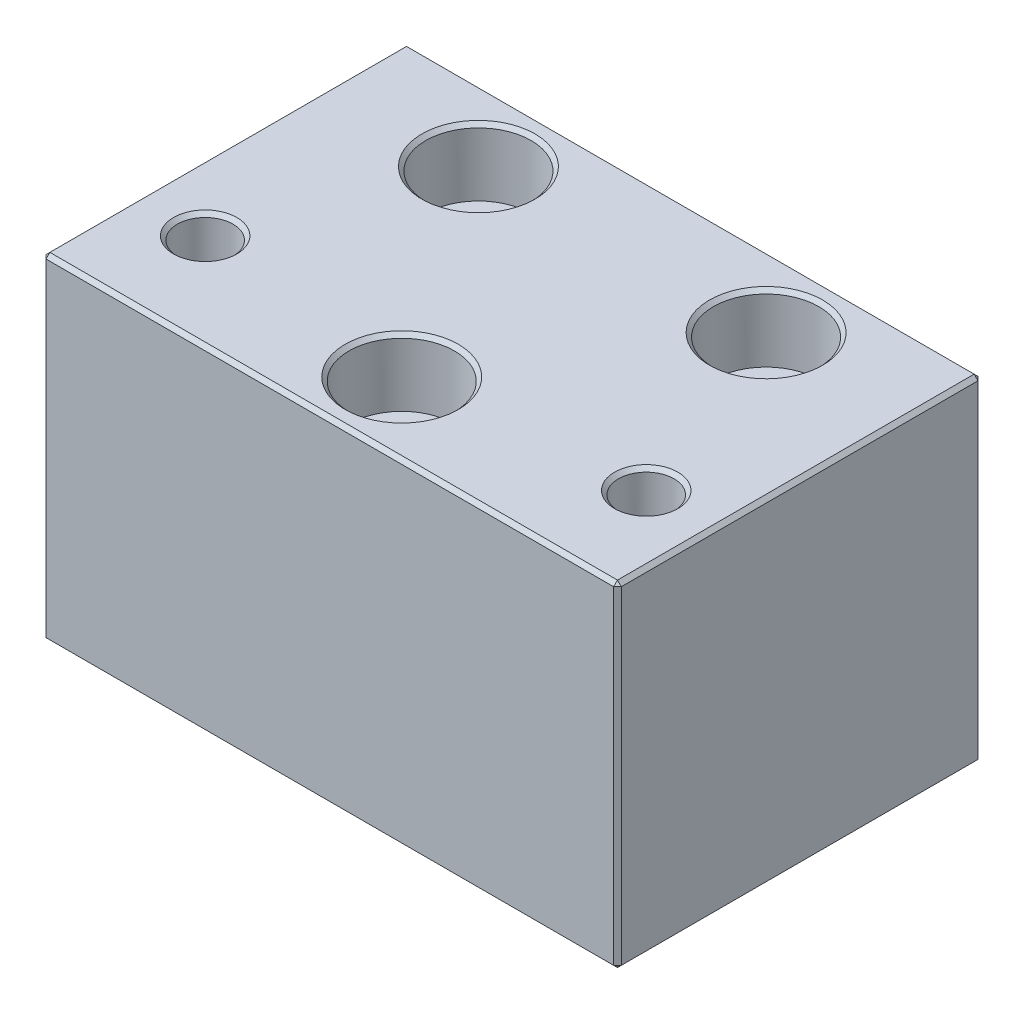
ISO-10303-21;
HEADER;
FILE_DESCRIPTION(('STEP AP214'),'2;1');
FILE_NAME('part.step','',(''),(''),'','','');
FILE_SCHEMA(('AUTOMOTIVE_DESIGN { 1 0 10303 214 1 1 1 1 }'));
ENDSEC;
DATA;
#1=APPLICATION_CONTEXT('core data for automotive mechanical design processes');
#2=APPLICATION_PROTOCOL_DEFINITION('international standard','automotive_design',2000,#1);
#3=PRODUCT_CONTEXT('',#1,'mechanical');
#4=PRODUCT('Part','Part','',(#3));
#5=PRODUCT_RELATED_PRODUCT_CATEGORY('part','',(#4));
#6=PRODUCT_DEFINITION_FORMATION('','',#4);
#7=PRODUCT_DEFINITION_CONTEXT('part definition',#1,'design');
#8=PRODUCT_DEFINITION('design','',#6,#7);
#9=PRODUCT_DEFINITION_SHAPE('','',#8);
#10=(LENGTH_UNIT() NAMED_UNIT(*) SI_UNIT(.MILLI.,.METRE.));
#11=(NAMED_UNIT(*) PLANE_ANGLE_UNIT() SI_UNIT($,.RADIAN.));
#12=(NAMED_UNIT(*) SI_UNIT($,.STERADIAN.) SOLID_ANGLE_UNIT());
#13=UNCERTAINTY_MEASURE_WITH_UNIT(LENGTH_MEASURE(1.E-05),#10,'distance_accuracy_value','');
#14=(GEOMETRIC_REPRESENTATION_CONTEXT(3) GLOBAL_UNCERTAINTY_ASSIGNED_CONTEXT((#13)) GLOBAL_UNIT_ASSIGNED_CONTEXT((#10,
#11,#12)) REPRESENTATION_CONTEXT('',''));
#15=CARTESIAN_POINT('',(0.,0.,0.));
#16=DIRECTION('',(0.,0.,1.));
#17=DIRECTION('',(1.,0.,0.));
#18=AXIS2_PLACEMENT_3D('',#15,#16,#17);
#19=CARTESIAN_POINT('',(-15.,0.,-11.5));
#20=DIRECTION('',(0.,1.,0.));
#21=DIRECTION('',(0.,0.,1.));
#22=AXIS2_PLACEMENT_3D('',#19,#20,#21);
#23=CYLINDRICAL_SURFACE('',#22,3.05);
#24=CARTESIAN_POINT('',(-15.,0.,-11.5));
#25=DIRECTION('',(0.,1.,0.));
#26=DIRECTION('',(0.,0.,1.));
#27=AXIS2_PLACEMENT_3D('',#24,#25,#26);
#28=CIRCLE('',#27,3.05);
#29=CARTESIAN_POINT('',(-15.,0.,-8.45));
#30=VERTEX_POINT('',#29);
#31=EDGE_CURVE('E301',#30,#30,#28,.T.);
#32=ORIENTED_EDGE('',*,*,#31,.F.);
#33=EDGE_LOOP('',(#32));
#34=FACE_BOUND('',#33,.T.);
#35=CARTESIAN_POINT('',(-15.,28.,-11.5));
#36=DIRECTION('',(0.,1.,0.));
#37=DIRECTION('',(0.,0.,1.));
#38=AXIS2_PLACEMENT_3D('',#35,#36,#37);
#39=CIRCLE('',#38,3.05);
#40=CARTESIAN_POINT('',(-15.,28.,-8.45));
#41=VERTEX_POINT('',#40);
#42=EDGE_CURVE('E305',#41,#41,#39,.F.);
#43=ORIENTED_EDGE('',*,*,#42,.F.);
#44=EDGE_LOOP('',(#43));
#45=FACE_BOUND('',#44,.T.);
#46=ADVANCED_FACE('F40',(#34,#45),#23,.F.);
#47=CARTESIAN_POINT('',(0.,0.,11.5));
#48=DIRECTION('',(0.,1.,0.));
#49=DIRECTION('',(0.,0.,1.));
#50=AXIS2_PLACEMENT_3D('',#47,#48,#49);
#51=CYLINDRICAL_SURFACE('',#50,3.05);
#52=CARTESIAN_POINT('',(0.,0.,11.5));
#53=DIRECTION('',(0.,1.,0.));
#54=DIRECTION('',(0.,0.,1.));
#55=AXIS2_PLACEMENT_3D('',#52,#53,#54);
#56=CIRCLE('',#55,3.05);
#57=CARTESIAN_POINT('',(0.,0.,14.55));
#58=VERTEX_POINT('',#57);
#59=EDGE_CURVE('E298',#58,#58,#56,.T.);
#60=ORIENTED_EDGE('',*,*,#59,.F.);
#61=EDGE_LOOP('',(#60));
#62=FACE_BOUND('',#61,.T.);
#63=CARTESIAN_POINT('',(0.,28.,11.5));
#64=DIRECTION('',(0.,1.,0.));
#65=DIRECTION('',(0.,0.,1.));
#66=AXIS2_PLACEMENT_3D('',#63,#64,#65);
#67=CIRCLE('',#66,3.05);
#68=CARTESIAN_POINT('',(0.,28.,14.55));
#69=VERTEX_POINT('',#68);
#70=EDGE_CURVE('E313',#69,#69,#67,.F.);
#71=ORIENTED_EDGE('',*,*,#70,.F.);
#72=EDGE_LOOP('',(#71));
#73=FACE_BOUND('',#72,.T.);
#74=ADVANCED_FACE('F385',(#62,#73),#51,.F.);
#75=CARTESIAN_POINT('',(15.,0.,-11.5));
#76=DIRECTION('',(0.,1.,0.));
#77=DIRECTION('',(0.,0.,1.));
#78=AXIS2_PLACEMENT_3D('',#75,#76,#77);
#79=CYLINDRICAL_SURFACE('',#78,3.05);
#80=CARTESIAN_POINT('',(15.,0.,-11.5));
#81=DIRECTION('',(0.,1.,0.));
#82=DIRECTION('',(0.,0.,-1.));
#83=AXIS2_PLACEMENT_3D('',#80,#81,#82);
#84=CIRCLE('',#83,3.05);
#85=CARTESIAN_POINT('',(15.,0.,-14.55));
#86=VERTEX_POINT('',#85);
#87=EDGE_CURVE('E302',#86,#86,#84,.T.);
#88=ORIENTED_EDGE('',*,*,#87,.F.);
#89=EDGE_LOOP('',(#88));
#90=FACE_BOUND('',#89,.T.);
#91=CARTESIAN_POINT('',(15.,28.,-11.5));
#92=DIRECTION('',(0.,1.,0.));
#93=DIRECTION('',(0.,0.,1.));
#94=AXIS2_PLACEMENT_3D('',#91,#92,#93);
#95=CIRCLE('',#94,3.05);
#96=CARTESIAN_POINT('',(15.,28.,-8.45000000000001));
#97=VERTEX_POINT('',#96);
#98=EDGE_CURVE('E310',#97,#97,#95,.F.);
#99=ORIENTED_EDGE('',*,*,#98,.F.);
#100=EDGE_LOOP('',(#99));
#101=FACE_BOUND('',#100,.T.);
#102=ADVANCED_FACE('F391',(#90,#101),#79,.F.);
#103=CARTESIAN_POINT('',(-30.,35.,-19.));
#104=DIRECTION('',(1.,0.,0.));
#105=DIRECTION('',(0.,0.,-1.));
#106=AXIS2_PLACEMENT_3D('',#103,#104,#105);
#107=PLANE('',#106);
#108=DIRECTION('',(0.,1.,0.));
#109=VECTOR('',#108,1.);
#110=CARTESIAN_POINT('',(-30.,35.,18.6));
#111=LINE('',#110,#109);
#112=CARTESIAN_POINT('',(-30.,0.399999999999998,18.6));
#113=VERTEX_POINT('',#112);
#114=CARTESIAN_POINT('',(-30.,34.6,18.6));
#115=VERTEX_POINT('',#114);
#116=EDGE_CURVE('E192',#113,#115,#111,.T.);
#117=ORIENTED_EDGE('',*,*,#116,.T.);
#118=DIRECTION('',(0.,0.,-1.));
#119=VECTOR('',#118,1.);
#120=CARTESIAN_POINT('',(-30.,34.6,-19.));
#121=LINE('',#120,#119);
#122=CARTESIAN_POINT('',(-30.,34.6,-18.6));
#123=VERTEX_POINT('',#122);
#124=EDGE_CURVE('E194',#115,#123,#121,.T.);
#125=ORIENTED_EDGE('',*,*,#124,.T.);
#126=DIRECTION('',(0.,-1.,0.));
#127=VECTOR('',#126,1.);
#128=CARTESIAN_POINT('',(-30.,35.,-18.6));
#129=LINE('',#128,#127);
#130=CARTESIAN_POINT('',(-30.,0.399999999999998,-18.6));
#131=VERTEX_POINT('',#130);
#132=EDGE_CURVE('E188',#123,#131,#129,.T.);
#133=ORIENTED_EDGE('',*,*,#132,.T.);
#134=DIRECTION('',(0.,0.,1.));
#135=VECTOR('',#134,1.);
#136=CARTESIAN_POINT('',(-30.,0.399999999999998,19.));
#137=LINE('',#136,#135);
#138=EDGE_CURVE('E190',#131,#113,#137,.T.);
#139=ORIENTED_EDGE('',*,*,#138,.T.);
#140=EDGE_LOOP('',(#117,#125,#133,#139));
#141=FACE_BOUND('',#140,.T.);
#142=ADVANCED_FACE('F414',(#141),#107,.F.);
#143=CARTESIAN_POINT('',(30.,35.,19.));
#144=DIRECTION('',(0.,0.,-1.));
#145=DIRECTION('',(-1.,0.,0.));
#146=AXIS2_PLACEMENT_3D('',#143,#144,#145);
#147=PLANE('',#146);
#148=DIRECTION('',(-1.,0.,0.));
#149=VECTOR('',#148,1.);
#150=CARTESIAN_POINT('',(30.,34.6,19.));
#151=LINE('',#150,#149);
#152=CARTESIAN_POINT('',(29.6,34.6,19.));
#153=VERTEX_POINT('',#152);
#154=CARTESIAN_POINT('',(-29.6,34.6,19.));
#155=VERTEX_POINT('',#154);
#156=EDGE_CURVE('E139',#153,#155,#151,.T.);
#157=ORIENTED_EDGE('',*,*,#156,.T.);
#158=DIRECTION('',(0.,-1.,0.));
#159=VECTOR('',#158,1.);
#160=CARTESIAN_POINT('',(-29.6,35.,19.));
#161=LINE('',#160,#159);
#162=CARTESIAN_POINT('',(-29.6,0.399999999999998,19.));
#163=VERTEX_POINT('',#162);
#164=EDGE_CURVE('E177',#155,#163,#161,.T.);
#165=ORIENTED_EDGE('',*,*,#164,.T.);
#166=DIRECTION('',(1.,0.,0.));
#167=VECTOR('',#166,1.);
#168=CARTESIAN_POINT('',(30.,0.399999999999998,19.));
#169=LINE('',#168,#167);
#170=CARTESIAN_POINT('',(29.6,0.399999999999998,19.));
#171=VERTEX_POINT('',#170);
#172=EDGE_CURVE('E170',#163,#171,#169,.T.);
#173=ORIENTED_EDGE('',*,*,#172,.T.);
#174=DIRECTION('',(0.,1.,0.));
#175=VECTOR('',#174,1.);
#176=CARTESIAN_POINT('',(29.6,35.,19.));
#177=LINE('',#176,#175);
#178=EDGE_CURVE('E168',#171,#153,#177,.T.);
#179=ORIENTED_EDGE('',*,*,#178,.T.);
#180=EDGE_LOOP('',(#157,#165,#173,#179));
#181=FACE_BOUND('',#180,.T.);
#182=ADVANCED_FACE('F354',(#181),#147,.F.);
#183=CARTESIAN_POINT('',(30.,35.,-19.));
#184=DIRECTION('',(-1.,0.,0.));
#185=DIRECTION('',(0.,0.,1.));
#186=AXIS2_PLACEMENT_3D('',#183,#184,#185);
#187=PLANE('',#186);
#188=DIRECTION('',(0.,0.,1.));
#189=VECTOR('',#188,1.);
#190=CARTESIAN_POINT('',(30.,34.6,-19.));
#191=LINE('',#190,#189);
#192=CARTESIAN_POINT('',(30.,34.6,-18.6));
#193=VERTEX_POINT('',#192);
#194=CARTESIAN_POINT('',(30.,34.6,18.6));
#195=VERTEX_POINT('',#194);
#196=EDGE_CURVE('E58',#193,#195,#191,.T.);
#197=ORIENTED_EDGE('',*,*,#196,.T.);
#198=DIRECTION('',(0.,-1.,0.));
#199=VECTOR('',#198,1.);
#200=CARTESIAN_POINT('',(30.,35.,18.6));
#201=LINE('',#200,#199);
#202=CARTESIAN_POINT('',(30.,0.399999999999998,18.6));
#203=VERTEX_POINT('',#202);
#204=EDGE_CURVE('E210',#195,#203,#201,.T.);
#205=ORIENTED_EDGE('',*,*,#204,.T.);
#206=DIRECTION('',(0.,0.,-1.));
#207=VECTOR('',#206,1.);
#208=CARTESIAN_POINT('',(30.,0.399999999999998,-19.));
#209=LINE('',#208,#207);
#210=CARTESIAN_POINT('',(30.,0.399999999999998,-18.6));
#211=VERTEX_POINT('',#210);
#212=EDGE_CURVE('E206',#203,#211,#209,.T.);
#213=ORIENTED_EDGE('',*,*,#212,.T.);
#214=DIRECTION('',(0.,1.,0.));
#215=VECTOR('',#214,1.);
#216=CARTESIAN_POINT('',(30.,35.,-18.6));
#217=LINE('',#216,#215);
#218=EDGE_CURVE('E63',#211,#193,#217,.T.);
#219=ORIENTED_EDGE('',*,*,#218,.T.);
#220=EDGE_LOOP('',(#197,#205,#213,#219));
#221=FACE_BOUND('',#220,.T.);
#222=ADVANCED_FACE('F360',(#221),#187,.F.);
#223=CARTESIAN_POINT('',(30.,35.,-19.));
#224=DIRECTION('',(0.,0.,1.));
#225=DIRECTION('',(1.,0.,0.));
#226=AXIS2_PLACEMENT_3D('',#223,#224,#225);
#227=PLANE('',#226);
#228=DIRECTION('',(0.,1.,0.));
#229=VECTOR('',#228,1.);
#230=CARTESIAN_POINT('',(-29.6,35.,-19.));
#231=LINE('',#230,#229);
#232=CARTESIAN_POINT('',(-29.6,0.399999999999998,-19.));
#233=VERTEX_POINT('',#232);
#234=CARTESIAN_POINT('',(-29.6,34.6,-19.));
#235=VERTEX_POINT('',#234);
#236=EDGE_CURVE('E201',#233,#235,#231,.T.);
#237=ORIENTED_EDGE('',*,*,#236,.T.);
#238=DIRECTION('',(1.,0.,0.));
#239=VECTOR('',#238,1.);
#240=CARTESIAN_POINT('',(30.,34.6,-19.));
#241=LINE('',#240,#239);
#242=CARTESIAN_POINT('',(29.6,34.6,-19.));
#243=VERTEX_POINT('',#242);
#244=EDGE_CURVE('E203',#235,#243,#241,.T.);
#245=ORIENTED_EDGE('',*,*,#244,.T.);
#246=DIRECTION('',(0.,-1.,0.));
#247=VECTOR('',#246,1.);
#248=CARTESIAN_POINT('',(29.6,35.,-19.));
#249=LINE('',#248,#247);
#250=CARTESIAN_POINT('',(29.6,0.399999999999998,-19.));
#251=VERTEX_POINT('',#250);
#252=EDGE_CURVE('E197',#243,#251,#249,.T.);
#253=ORIENTED_EDGE('',*,*,#252,.T.);
#254=DIRECTION('',(-1.,0.,0.));
#255=VECTOR('',#254,1.);
#256=CARTESIAN_POINT('',(-30.,0.399999999999998,-19.));
#257=LINE('',#256,#255);
#258=EDGE_CURVE('E199',#251,#233,#257,.T.);
#259=ORIENTED_EDGE('',*,*,#258,.T.);
#260=EDGE_LOOP('',(#237,#245,#253,#259));
#261=FACE_BOUND('',#260,.T.);
#262=ADVANCED_FACE('F403',(#261),#227,.F.);
#263=CARTESIAN_POINT('',(0.,35.,0.));
#264=DIRECTION('',(0.,-1.,0.));
#265=DIRECTION('',(0.,0.,-1.));
#266=AXIS2_PLACEMENT_3D('',#263,#264,#265);
#267=PLANE('',#266);
#268=DIRECTION('',(0.,0.,1.));
#269=VECTOR('',#268,1.);
#270=CARTESIAN_POINT('',(-29.6,35.,0.));
#271=LINE('',#270,#269);
#272=CARTESIAN_POINT('',(-29.6,35.,-18.6));
#273=VERTEX_POINT('',#272);
#274=CARTESIAN_POINT('',(-29.6,35.,18.6));
#275=VERTEX_POINT('',#274);
#276=EDGE_CURVE('E166',#273,#275,#271,.T.);
#277=ORIENTED_EDGE('',*,*,#276,.T.);
#278=DIRECTION('',(1.,0.,0.));
#279=VECTOR('',#278,1.);
#280=CARTESIAN_POINT('',(0.,35.,18.6));
#281=LINE('',#280,#279);
#282=CARTESIAN_POINT('',(29.6,35.,18.6));
#283=VERTEX_POINT('',#282);
#284=EDGE_CURVE('E137',#275,#283,#281,.T.);
#285=ORIENTED_EDGE('',*,*,#284,.T.);
#286=DIRECTION('',(0.,0.,-1.));
#287=VECTOR('',#286,1.);
#288=CARTESIAN_POINT('',(29.6,35.,0.));
#289=LINE('',#288,#287);
#290=CARTESIAN_POINT('',(29.6,35.,-18.6));
#291=VERTEX_POINT('',#290);
#292=EDGE_CURVE('E154',#283,#291,#289,.T.);
#293=ORIENTED_EDGE('',*,*,#292,.T.);
#294=DIRECTION('',(-1.,0.,0.));
#295=VECTOR('',#294,1.);
#296=CARTESIAN_POINT('',(0.,35.,-18.6));
#297=LINE('',#296,#295);
#298=EDGE_CURVE('E160',#291,#273,#297,.T.);
#299=ORIENTED_EDGE('',*,*,#298,.T.);
#300=EDGE_LOOP('',(#277,#285,#293,#299));
#301=FACE_BOUND('',#300,.T.);
#302=CARTESIAN_POINT('',(23.,35.,8.99999999999999));
#303=DIRECTION('',(0.,-1.,0.));
#304=DIRECTION('',(0.,0.,-1.));
#305=AXIS2_PLACEMENT_3D('',#302,#303,#304);
#306=CIRCLE('',#305,3.29999999999999);
#307=CARTESIAN_POINT('',(23.,35.,5.7));
#308=VERTEX_POINT('',#307);
#309=EDGE_CURVE('E161',#308,#308,#306,.T.);
#310=ORIENTED_EDGE('',*,*,#309,.T.);
#311=EDGE_LOOP('',(#310));
#312=FACE_BOUND('',#311,.T.);
#313=CARTESIAN_POINT('',(-23.,35.,9.));
#314=DIRECTION('',(0.,-1.,0.));
#315=DIRECTION('',(0.,0.,-1.));
#316=AXIS2_PLACEMENT_3D('',#313,#314,#315);
#317=CIRCLE('',#316,3.29999999999999);
#318=CARTESIAN_POINT('',(-23.,35.,5.70000000000001));
#319=VERTEX_POINT('',#318);
#320=EDGE_CURVE('E326',#319,#319,#317,.T.);
#321=ORIENTED_EDGE('',*,*,#320,.T.);
#322=EDGE_LOOP('',(#321));
#323=FACE_BOUND('',#322,.T.);
#324=CARTESIAN_POINT('',(0.,35.,11.5));
#325=DIRECTION('',(0.,-1.,0.));
#326=DIRECTION('',(0.,0.,-1.));
#327=AXIS2_PLACEMENT_3D('',#324,#325,#326);
#328=CIRCLE('',#327,5.89999999999997);
#329=CARTESIAN_POINT('',(0.,35.,5.60000000000003));
#330=VERTEX_POINT('',#329);
#331=EDGE_CURVE('E323',#330,#330,#328,.T.);
#332=ORIENTED_EDGE('',*,*,#331,.T.);
#333=EDGE_LOOP('',(#332));
#334=FACE_BOUND('',#333,.T.);
#335=CARTESIAN_POINT('',(15.,35.,-11.5));
#336=DIRECTION('',(0.,-1.,0.));
#337=DIRECTION('',(0.,0.,-1.));
#338=AXIS2_PLACEMENT_3D('',#335,#336,#337);
#339=CIRCLE('',#338,5.89999999999998);
#340=CARTESIAN_POINT('',(15.,35.,-17.4));
#341=VERTEX_POINT('',#340);
#342=EDGE_CURVE('E320',#341,#341,#339,.T.);
#343=ORIENTED_EDGE('',*,*,#342,.T.);
#344=EDGE_LOOP('',(#343));
#345=FACE_BOUND('',#344,.T.);
#346=CARTESIAN_POINT('',(-15.,35.,-11.5));
#347=DIRECTION('',(0.,-1.,0.));
#348=DIRECTION('',(0.,0.,-1.));
#349=AXIS2_PLACEMENT_3D('',#346,#347,#348);
#350=CIRCLE('',#349,5.9);
#351=CARTESIAN_POINT('',(-15.,35.,-17.4));
#352=VERTEX_POINT('',#351);
#353=EDGE_CURVE('E296',#352,#352,#350,.T.);
#354=ORIENTED_EDGE('',*,*,#353,.T.);
#355=EDGE_LOOP('',(#354));
#356=FACE_BOUND('',#355,.T.);
#357=ADVANCED_FACE('F163',(#301,#312,#323,#334,#345,#356),#267,.F.);
#358=CARTESIAN_POINT('',(0.,0.,0.));
#359=DIRECTION('',(0.,-1.,0.));
#360=DIRECTION('',(0.,0.,-1.));
#361=AXIS2_PLACEMENT_3D('',#358,#359,#360);
#362=PLANE('',#361);
#363=DIRECTION('',(0.,0.,1.));
#364=VECTOR('',#363,1.);
#365=CARTESIAN_POINT('',(29.6,0.,19.));
#366=LINE('',#365,#364);
#367=CARTESIAN_POINT('',(29.6,0.,-18.6));
#368=VERTEX_POINT('',#367);
#369=CARTESIAN_POINT('',(29.6,0.,18.6));
#370=VERTEX_POINT('',#369);
#371=EDGE_CURVE('E179',#368,#370,#366,.T.);
#372=ORIENTED_EDGE('',*,*,#371,.T.);
#373=DIRECTION('',(-1.,0.,0.));
#374=VECTOR('',#373,1.);
#375=CARTESIAN_POINT('',(-30.,0.,18.6));
#376=LINE('',#375,#374);
#377=CARTESIAN_POINT('',(-29.6,0.,18.6));
#378=VERTEX_POINT('',#377);
#379=EDGE_CURVE('E185',#370,#378,#376,.T.);
#380=ORIENTED_EDGE('',*,*,#379,.T.);
#381=DIRECTION('',(0.,0.,-1.));
#382=VECTOR('',#381,1.);
#383=CARTESIAN_POINT('',(-29.6,0.,-19.));
#384=LINE('',#383,#382);
#385=CARTESIAN_POINT('',(-29.6,0.,-18.6));
#386=VERTEX_POINT('',#385);
#387=EDGE_CURVE('E183',#378,#386,#384,.T.);
#388=ORIENTED_EDGE('',*,*,#387,.T.);
#389=DIRECTION('',(1.,0.,0.));
#390=VECTOR('',#389,1.);
#391=CARTESIAN_POINT('',(30.,0.,-18.6));
#392=LINE('',#391,#390);
#393=EDGE_CURVE('E181',#386,#368,#392,.T.);
#394=ORIENTED_EDGE('',*,*,#393,.T.);
#395=EDGE_LOOP('',(#372,#380,#388,#394));
#396=FACE_BOUND('',#395,.T.);
#397=CARTESIAN_POINT('',(-23.,0.,9.));
#398=DIRECTION('',(0.,1.,0.));
#399=DIRECTION('',(0.,0.,1.));
#400=AXIS2_PLACEMENT_3D('',#397,#398,#399);
#401=CIRCLE('',#400,2.9);
#402=CARTESIAN_POINT('',(-23.,0.,11.9));
#403=VERTEX_POINT('',#402);
#404=EDGE_CURVE('E293',#403,#403,#401,.T.);
#405=ORIENTED_EDGE('',*,*,#404,.T.);
#406=EDGE_LOOP('',(#405));
#407=FACE_BOUND('',#406,.T.);
#408=ORIENTED_EDGE('',*,*,#87,.T.);
#409=EDGE_LOOP('',(#408));
#410=FACE_BOUND('',#409,.T.);
#411=ORIENTED_EDGE('',*,*,#59,.T.);
#412=EDGE_LOOP('',(#411));
#413=FACE_BOUND('',#412,.T.);
#414=ORIENTED_EDGE('',*,*,#31,.T.);
#415=EDGE_LOOP('',(#414));
#416=FACE_BOUND('',#415,.T.);
#417=CARTESIAN_POINT('',(23.,0.,8.99999999999999));
#418=DIRECTION('',(0.,1.,0.));
#419=DIRECTION('',(0.,0.,1.));
#420=AXIS2_PLACEMENT_3D('',#417,#418,#419);
#421=CIRCLE('',#420,2.9);
#422=CARTESIAN_POINT('',(23.,0.,11.9));
#423=VERTEX_POINT('',#422);
#424=EDGE_CURVE('E297',#423,#423,#421,.T.);
#425=ORIENTED_EDGE('',*,*,#424,.T.);
#426=EDGE_LOOP('',(#425));
#427=FACE_BOUND('',#426,.T.);
#428=ADVANCED_FACE('F402',(#396,#407,#410,#413,#416,#427),#362,.T.);
#429=CARTESIAN_POINT('',(23.,0.,8.99999999999999));
#430=DIRECTION('',(0.,1.,0.));
#431=DIRECTION('',(0.,0.,1.));
#432=AXIS2_PLACEMENT_3D('',#429,#430,#431);
#433=CYLINDRICAL_SURFACE('',#432,2.9);
#434=CARTESIAN_POINT('',(23.,34.6,8.99999999999999));
#435=DIRECTION('',(0.,-1.,0.));
#436=DIRECTION('',(0.,0.,-1.));
#437=AXIS2_PLACEMENT_3D('',#434,#435,#436);
#438=CIRCLE('',#437,2.9);
#439=CARTESIAN_POINT('',(23.,34.6,6.09999999999999));
#440=VERTEX_POINT('',#439);
#441=EDGE_CURVE('E212',#440,#440,#438,.F.);
#442=ORIENTED_EDGE('',*,*,#441,.T.);
#443=EDGE_LOOP('',(#442));
#444=FACE_BOUND('',#443,.T.);
#445=ORIENTED_EDGE('',*,*,#424,.F.);
#446=EDGE_LOOP('',(#445));
#447=FACE_BOUND('',#446,.T.);
#448=ADVANCED_FACE('F398',(#444,#447),#433,.F.);
#449=CARTESIAN_POINT('',(-23.,0.,9.));
#450=DIRECTION('',(0.,1.,0.));
#451=DIRECTION('',(0.,0.,1.));
#452=AXIS2_PLACEMENT_3D('',#449,#450,#451);
#453=CYLINDRICAL_SURFACE('',#452,2.9);
#454=CARTESIAN_POINT('',(-23.,34.6,9.));
#455=DIRECTION('',(0.,-1.,0.));
#456=DIRECTION('',(0.,0.,-1.));
#457=AXIS2_PLACEMENT_3D('',#454,#455,#456);
#458=CIRCLE('',#457,2.9);
#459=CARTESIAN_POINT('',(-23.,34.6,6.1));
#460=VERTEX_POINT('',#459);
#461=EDGE_CURVE('E215',#460,#460,#458,.F.);
#462=ORIENTED_EDGE('',*,*,#461,.T.);
#463=EDGE_LOOP('',(#462));
#464=FACE_BOUND('',#463,.T.);
#465=ORIENTED_EDGE('',*,*,#404,.F.);
#466=EDGE_LOOP('',(#465));
#467=FACE_BOUND('',#466,.T.);
#468=ADVANCED_FACE('F553',(#464,#467),#453,.F.);
#469=CARTESIAN_POINT('',(15.,28.,-11.5));
#470=DIRECTION('',(0.,1.,0.));
#471=DIRECTION('',(0.,0.,1.));
#472=AXIS2_PLACEMENT_3D('',#469,#470,#471);
#473=PLANE('',#472);
#474=CARTESIAN_POINT('',(15.,28.,-11.5));
#475=DIRECTION('',(0.,1.,0.));
#476=DIRECTION('',(0.,0.,1.));
#477=AXIS2_PLACEMENT_3D('',#474,#475,#476);
#478=CIRCLE('',#477,5.5);
#479=CARTESIAN_POINT('',(15.,28.,-6.00000000000001));
#480=VERTEX_POINT('',#479);
#481=EDGE_CURVE('E284',#480,#480,#478,.T.);
#482=ORIENTED_EDGE('',*,*,#481,.T.);
#483=EDGE_LOOP('',(#482));
#484=FACE_BOUND('',#483,.T.);
#485=ORIENTED_EDGE('',*,*,#98,.T.);
#486=EDGE_LOOP('',(#485));
#487=FACE_BOUND('',#486,.T.);
#488=ADVANCED_FACE('F547',(#484,#487),#473,.T.);
#489=CARTESIAN_POINT('',(15.,28.,-11.5));
#490=DIRECTION('',(0.,1.,0.));
#491=DIRECTION('',(0.,0.,1.));
#492=AXIS2_PLACEMENT_3D('',#489,#490,#491);
#493=CYLINDRICAL_SURFACE('',#492,5.5);
#494=CARTESIAN_POINT('',(15.,34.6,-11.5));
#495=DIRECTION('',(0.,-1.,0.));
#496=DIRECTION('',(0.,0.,-1.));
#497=AXIS2_PLACEMENT_3D('',#494,#495,#496);
#498=CIRCLE('',#497,5.5);
#499=CARTESIAN_POINT('',(15.,34.6,-17.));
#500=VERTEX_POINT('',#499);
#501=EDGE_CURVE('E50',#500,#500,#498,.F.);
#502=ORIENTED_EDGE('',*,*,#501,.T.);
#503=EDGE_LOOP('',(#502));
#504=FACE_BOUND('',#503,.T.);
#505=ORIENTED_EDGE('',*,*,#481,.F.);
#506=EDGE_LOOP('',(#505));
#507=FACE_BOUND('',#506,.T.);
#508=ADVANCED_FACE('F543',(#504,#507),#493,.F.);
#509=CARTESIAN_POINT('',(0.,28.,11.5));
#510=DIRECTION('',(0.,1.,0.));
#511=DIRECTION('',(0.,0.,1.));
#512=AXIS2_PLACEMENT_3D('',#509,#510,#511);
#513=PLANE('',#512);
#514=CARTESIAN_POINT('',(0.,28.,11.5));
#515=DIRECTION('',(0.,1.,0.));
#516=DIRECTION('',(0.,0.,1.));
#517=AXIS2_PLACEMENT_3D('',#514,#515,#516);
#518=CIRCLE('',#517,5.5);
#519=CARTESIAN_POINT('',(0.,28.,17.));
#520=VERTEX_POINT('',#519);
#521=EDGE_CURVE('E278',#520,#520,#518,.T.);
#522=ORIENTED_EDGE('',*,*,#521,.T.);
#523=EDGE_LOOP('',(#522));
#524=FACE_BOUND('',#523,.T.);
#525=ORIENTED_EDGE('',*,*,#70,.T.);
#526=EDGE_LOOP('',(#525));
#527=FACE_BOUND('',#526,.T.);
#528=ADVANCED_FACE('F546',(#524,#527),#513,.T.);
#529=CARTESIAN_POINT('',(0.,28.,11.5));
#530=DIRECTION('',(0.,1.,0.));
#531=DIRECTION('',(0.,0.,1.));
#532=AXIS2_PLACEMENT_3D('',#529,#530,#531);
#533=CYLINDRICAL_SURFACE('',#532,5.5);
#534=CARTESIAN_POINT('',(0.,34.6,11.5));
#535=DIRECTION('',(0.,-1.,0.));
#536=DIRECTION('',(0.,0.,-1.));
#537=AXIS2_PLACEMENT_3D('',#534,#535,#536);
#538=CIRCLE('',#537,5.5);
#539=CARTESIAN_POINT('',(0.,34.6,6.));
#540=VERTEX_POINT('',#539);
#541=EDGE_CURVE('E218',#540,#540,#538,.F.);
#542=ORIENTED_EDGE('',*,*,#541,.T.);
#543=EDGE_LOOP('',(#542));
#544=FACE_BOUND('',#543,.T.);
#545=ORIENTED_EDGE('',*,*,#521,.F.);
#546=EDGE_LOOP('',(#545));
#547=FACE_BOUND('',#546,.T.);
#548=ADVANCED_FACE('F566',(#544,#547),#533,.F.);
#549=CARTESIAN_POINT('',(-15.,28.,-11.5));
#550=DIRECTION('',(0.,1.,0.));
#551=DIRECTION('',(0.,0.,1.));
#552=AXIS2_PLACEMENT_3D('',#549,#550,#551);
#553=PLANE('',#552);
#554=CARTESIAN_POINT('',(-15.,28.,-11.5));
#555=DIRECTION('',(0.,1.,0.));
#556=DIRECTION('',(0.,0.,1.));
#557=AXIS2_PLACEMENT_3D('',#554,#555,#556);
#558=CIRCLE('',#557,5.5);
#559=CARTESIAN_POINT('',(-15.,28.,-6.));
#560=VERTEX_POINT('',#559);
#561=EDGE_CURVE('E289',#560,#560,#558,.T.);
#562=ORIENTED_EDGE('',*,*,#561,.T.);
#563=EDGE_LOOP('',(#562));
#564=FACE_BOUND('',#563,.T.);
#565=ORIENTED_EDGE('',*,*,#42,.T.);
#566=EDGE_LOOP('',(#565));
#567=FACE_BOUND('',#566,.T.);
#568=ADVANCED_FACE('F569',(#564,#567),#553,.T.);
#569=CARTESIAN_POINT('',(-15.,28.,-11.5));
#570=DIRECTION('',(0.,1.,0.));
#571=DIRECTION('',(0.,0.,1.));
#572=AXIS2_PLACEMENT_3D('',#569,#570,#571);
#573=CYLINDRICAL_SURFACE('',#572,5.5);
#574=CARTESIAN_POINT('',(-15.,34.6,-11.5));
#575=DIRECTION('',(0.,-1.,0.));
#576=DIRECTION('',(0.,0.,-1.));
#577=AXIS2_PLACEMENT_3D('',#574,#575,#576);
#578=CIRCLE('',#577,5.5);
#579=CARTESIAN_POINT('',(-15.,34.6,-17.));
#580=VERTEX_POINT('',#579);
#581=EDGE_CURVE('E11',#580,#580,#578,.F.);
#582=ORIENTED_EDGE('',*,*,#581,.T.);
#583=EDGE_LOOP('',(#582));
#584=FACE_BOUND('',#583,.T.);
#585=ORIENTED_EDGE('',*,*,#561,.F.);
#586=EDGE_LOOP('',(#585));
#587=FACE_BOUND('',#586,.T.);
#588=ADVANCED_FACE('F509',(#584,#587),#573,.F.);
#589=CARTESIAN_POINT('',(30.,0.399999999999998,-19.));
#590=DIRECTION('',(0.,-0.707106781186555,-0.70710678118654));
#591=DIRECTION('',(1.,0.,0.));
#592=AXIS2_PLACEMENT_3D('',#589,#590,#591);
#593=PLANE('',#592);
#594=DIRECTION('',(0.,-0.70710678118654,0.707106781186555));
#595=VECTOR('',#594,1.);
#596=CARTESIAN_POINT('',(-29.6,0.,-18.6));
#597=LINE('',#596,#595);
#598=EDGE_CURVE('E45',#233,#386,#597,.T.);
#599=ORIENTED_EDGE('',*,*,#598,.F.);
#600=ORIENTED_EDGE('',*,*,#258,.F.);
#601=DIRECTION('',(0.,0.70710678118654,-0.707106781186555));
#602=VECTOR('',#601,1.);
#603=CARTESIAN_POINT('',(29.6,0.,-18.6));
#604=LINE('',#603,#602);
#605=EDGE_CURVE('E271',#368,#251,#604,.T.);
#606=ORIENTED_EDGE('',*,*,#605,.F.);
#607=ORIENTED_EDGE('',*,*,#393,.F.);
#608=EDGE_LOOP('',(#599,#600,#606,#607));
#609=FACE_BOUND('',#608,.T.);
#610=ADVANCED_FACE('F506',(#609),#593,.T.);
#611=CARTESIAN_POINT('',(-29.6,0.,-18.6));
#612=DIRECTION('',(-0.577350269189616,-0.577350269189636,-0.577350269189626));
#613=DIRECTION('',(0.,0.707106781186541,-0.707106781186554));
#614=AXIS2_PLACEMENT_3D('',#611,#612,#613);
#615=PLANE('',#614);
#616=DIRECTION('',(-0.707106781186554,0.,0.707106781186541));
#617=VECTOR('',#616,1.);
#618=CARTESIAN_POINT('',(-29.8,0.399999999999998,-18.8));
#619=LINE('',#618,#617);
#620=EDGE_CURVE('E266',#233,#131,#619,.T.);
#621=ORIENTED_EDGE('',*,*,#620,.F.);
#622=ORIENTED_EDGE('',*,*,#598,.T.);
#623=DIRECTION('',(-0.707106781186554,0.707106781186541,0.));
#624=VECTOR('',#623,1.);
#625=CARTESIAN_POINT('',(-29.6,0.,-18.6));
#626=LINE('',#625,#624);
#627=EDGE_CURVE('E269',#131,#386,#626,.F.);
#628=ORIENTED_EDGE('',*,*,#627,.F.);
#629=EDGE_LOOP('',(#621,#622,#628));
#630=FACE_BOUND('',#629,.T.);
#631=ADVANCED_FACE('F502',(#630),#615,.T.);
#632=CARTESIAN_POINT('',(29.6,0.,-18.6));
#633=DIRECTION('',(0.577350269189616,-0.577350269189636,-0.577350269189626));
#634=DIRECTION('',(0.,0.707106781186541,-0.707106781186554));
#635=AXIS2_PLACEMENT_3D('',#632,#633,#634);
#636=PLANE('',#635);
#637=DIRECTION('',(-0.707106781186554,-0.707106781186541,0.));
#638=VECTOR('',#637,1.);
#639=CARTESIAN_POINT('',(29.6,0.,-18.6));
#640=LINE('',#639,#638);
#641=EDGE_CURVE('E260',#368,#211,#640,.F.);
#642=ORIENTED_EDGE('',*,*,#641,.F.);
#643=ORIENTED_EDGE('',*,*,#605,.T.);
#644=DIRECTION('',(-0.707106781186554,0.,-0.707106781186541));
#645=VECTOR('',#644,1.);
#646=CARTESIAN_POINT('',(29.8,0.399999999999998,-18.8));
#647=LINE('',#646,#645);
#648=EDGE_CURVE('E263',#211,#251,#647,.T.);
#649=ORIENTED_EDGE('',*,*,#648,.F.);
#650=EDGE_LOOP('',(#642,#643,#649));
#651=FACE_BOUND('',#650,.T.);
#652=ADVANCED_FACE('F366',(#651),#636,.T.);
#653=CARTESIAN_POINT('',(-30.,0.399999999999998,-19.));
#654=DIRECTION('',(-0.707106781186541,-0.707106781186554,0.));
#655=DIRECTION('',(0.,0.,-1.));
#656=AXIS2_PLACEMENT_3D('',#653,#654,#655);
#657=PLANE('',#656);
#658=ORIENTED_EDGE('',*,*,#627,.T.);
#659=ORIENTED_EDGE('',*,*,#387,.F.);
#660=DIRECTION('',(0.707106781186554,-0.707106781186541,0.));
#661=VECTOR('',#660,1.);
#662=CARTESIAN_POINT('',(-29.6,0.,18.6));
#663=LINE('',#662,#661);
#664=EDGE_CURVE('E255',#113,#378,#663,.T.);
#665=ORIENTED_EDGE('',*,*,#664,.F.);
#666=ORIENTED_EDGE('',*,*,#138,.F.);
#667=EDGE_LOOP('',(#658,#659,#665,#666));
#668=FACE_BOUND('',#667,.T.);
#669=ADVANCED_FACE('F493',(#668),#657,.T.);
#670=CARTESIAN_POINT('',(-30.,35.,-18.6));
#671=DIRECTION('',(0.707106781186541,0.,0.707106781186554));
#672=DIRECTION('',(0.,-1.,0.));
#673=AXIS2_PLACEMENT_3D('',#670,#671,#672);
#674=PLANE('',#673);
#675=ORIENTED_EDGE('',*,*,#620,.T.);
#676=ORIENTED_EDGE('',*,*,#132,.F.);
#677=DIRECTION('',(0.707106781186554,0.,-0.707106781186541));
#678=VECTOR('',#677,1.);
#679=CARTESIAN_POINT('',(-30.,34.6,-18.6));
#680=LINE('',#679,#678);
#681=EDGE_CURVE('E252',#235,#123,#680,.F.);
#682=ORIENTED_EDGE('',*,*,#681,.F.);
#683=ORIENTED_EDGE('',*,*,#236,.F.);
#684=EDGE_LOOP('',(#675,#676,#682,#683));
#685=FACE_BOUND('',#684,.T.);
#686=ADVANCED_FACE('F488',(#685),#674,.F.);
#687=CARTESIAN_POINT('',(0.,35.,-18.6));
#688=DIRECTION('',(0.,-0.707106781186543,0.707106781186552));
#689=DIRECTION('',(-1.,0.,0.));
#690=AXIS2_PLACEMENT_3D('',#687,#688,#689);
#691=PLANE('',#690);
#692=DIRECTION('',(0.,-0.707106781186552,-0.707106781186543));
#693=VECTOR('',#692,1.);
#694=CARTESIAN_POINT('',(29.6,34.6,-19.));
#695=LINE('',#694,#693);
#696=EDGE_CURVE('E246',#243,#291,#695,.F.);
#697=ORIENTED_EDGE('',*,*,#696,.F.);
#698=ORIENTED_EDGE('',*,*,#244,.F.);
#699=DIRECTION('',(0.,0.707106781186552,0.707106781186543));
#700=VECTOR('',#699,1.);
#701=CARTESIAN_POINT('',(-29.6,34.8,-18.8));
#702=LINE('',#701,#700);
#703=EDGE_CURVE('E249',#273,#235,#702,.F.);
#704=ORIENTED_EDGE('',*,*,#703,.F.);
#705=ORIENTED_EDGE('',*,*,#298,.F.);
#706=EDGE_LOOP('',(#697,#698,#704,#705));
#707=FACE_BOUND('',#706,.T.);
#708=ADVANCED_FACE('F335',(#707),#691,.F.);
#709=CARTESIAN_POINT('',(29.6,35.,-19.));
#710=DIRECTION('',(-0.707106781186541,0.,0.707106781186554));
#711=DIRECTION('',(0.,-1.,0.));
#712=AXIS2_PLACEMENT_3D('',#709,#710,#711);
#713=PLANE('',#712);
#714=ORIENTED_EDGE('',*,*,#648,.T.);
#715=ORIENTED_EDGE('',*,*,#252,.F.);
#716=DIRECTION('',(0.707106781186554,0.,0.707106781186541));
#717=VECTOR('',#716,1.);
#718=CARTESIAN_POINT('',(29.6,34.6,-19.));
#719=LINE('',#718,#717);
#720=EDGE_CURVE('E244',#193,#243,#719,.F.);
#721=ORIENTED_EDGE('',*,*,#720,.F.);
#722=ORIENTED_EDGE('',*,*,#218,.F.);
#723=EDGE_LOOP('',(#714,#715,#721,#722));
#724=FACE_BOUND('',#723,.T.);
#725=ADVANCED_FACE('F369',(#724),#713,.F.);
#726=CARTESIAN_POINT('',(30.,0.399999999999998,-19.));
#727=DIRECTION('',(0.707106781186541,-0.707106781186554,0.));
#728=DIRECTION('',(0.,0.,1.));
#729=AXIS2_PLACEMENT_3D('',#726,#727,#728);
#730=PLANE('',#729);
#731=ORIENTED_EDGE('',*,*,#641,.T.);
#732=ORIENTED_EDGE('',*,*,#212,.F.);
#733=DIRECTION('',(0.707106781186554,0.707106781186541,0.));
#734=VECTOR('',#733,1.);
#735=CARTESIAN_POINT('',(29.8,0.200000000000001,18.6));
#736=LINE('',#735,#734);
#737=EDGE_CURVE('E241',#370,#203,#736,.T.);
#738=ORIENTED_EDGE('',*,*,#737,.F.);
#739=ORIENTED_EDGE('',*,*,#371,.F.);
#740=EDGE_LOOP('',(#731,#732,#738,#739));
#741=FACE_BOUND('',#740,.T.);
#742=ADVANCED_FACE('F365',(#741),#730,.T.);
#743=CARTESIAN_POINT('',(30.,0.399999999999998,19.));
#744=DIRECTION('',(0.,-0.707106781186555,0.70710678118654));
#745=DIRECTION('',(-1.,0.,0.));
#746=AXIS2_PLACEMENT_3D('',#743,#744,#745);
#747=PLANE('',#746);
#748=DIRECTION('',(0.,0.70710678118654,0.707106781186555));
#749=VECTOR('',#748,1.);
#750=CARTESIAN_POINT('',(-29.6,0.,18.6));
#751=LINE('',#750,#749);
#752=EDGE_CURVE('E257',#378,#163,#751,.T.);
#753=ORIENTED_EDGE('',*,*,#752,.F.);
#754=ORIENTED_EDGE('',*,*,#379,.F.);
#755=DIRECTION('',(0.,-0.70710678118654,-0.707106781186555));
#756=VECTOR('',#755,1.);
#757=CARTESIAN_POINT('',(29.6,0.399999999999998,19.));
#758=LINE('',#757,#756);
#759=EDGE_CURVE('E238',#171,#370,#758,.T.);
#760=ORIENTED_EDGE('',*,*,#759,.F.);
#761=ORIENTED_EDGE('',*,*,#172,.F.);
#762=EDGE_LOOP('',(#753,#754,#760,#761));
#763=FACE_BOUND('',#762,.T.);
#764=ADVANCED_FACE('F471',(#763),#747,.T.);
#765=CARTESIAN_POINT('',(-29.6,0.,18.6));
#766=DIRECTION('',(-0.577350269189624,-0.577350269189639,0.577350269189614));
#767=DIRECTION('',(0.707106781186557,-0.707106781186538,0.));
#768=AXIS2_PLACEMENT_3D('',#765,#766,#767);
#769=PLANE('',#768);
#770=ORIENTED_EDGE('',*,*,#664,.T.);
#771=ORIENTED_EDGE('',*,*,#752,.T.);
#772=DIRECTION('',(0.707106781186541,0.,0.707106781186554));
#773=VECTOR('',#772,1.);
#774=CARTESIAN_POINT('',(-29.8,0.399999999999998,18.8));
#775=LINE('',#774,#773);
#776=EDGE_CURVE('E235',#113,#163,#775,.T.);
#777=ORIENTED_EDGE('',*,*,#776,.F.);
#778=EDGE_LOOP('',(#770,#771,#777));
#779=FACE_BOUND('',#778,.T.);
#780=ADVANCED_FACE('F381',(#779),#769,.T.);
#781=CARTESIAN_POINT('',(-30.,34.6,-18.6));
#782=DIRECTION('',(-0.577350269189624,0.577350269189619,-0.577350269189634));
#783=DIRECTION('',(-0.707106781186554,0.,0.707106781186541));
#784=AXIS2_PLACEMENT_3D('',#781,#782,#783);
#785=PLANE('',#784);
#786=ORIENTED_EDGE('',*,*,#703,.T.);
#787=ORIENTED_EDGE('',*,*,#681,.T.);
#788=DIRECTION('',(-0.707106781186541,-0.707106781186554,0.));
#789=VECTOR('',#788,1.);
#790=CARTESIAN_POINT('',(-30.,34.6,-18.6));
#791=LINE('',#790,#789);
#792=EDGE_CURVE('E233',#273,#123,#791,.T.);
#793=ORIENTED_EDGE('',*,*,#792,.F.);
#794=EDGE_LOOP('',(#786,#787,#793));
#795=FACE_BOUND('',#794,.T.);
#796=ADVANCED_FACE('F338',(#795),#785,.T.);
#797=CARTESIAN_POINT('',(29.6,34.6,-19.));
#798=DIRECTION('',(0.577350269189614,0.577350269189629,-0.577350269189634));
#799=DIRECTION('',(0.,0.707106781186551,0.707106781186544));
#800=AXIS2_PLACEMENT_3D('',#797,#798,#799);
#801=PLANE('',#800);
#802=ORIENTED_EDGE('',*,*,#720,.T.);
#803=ORIENTED_EDGE('',*,*,#696,.T.);
#804=DIRECTION('',(-0.707106781186554,0.707106781186541,0.));
#805=VECTOR('',#804,1.);
#806=CARTESIAN_POINT('',(29.8,34.8,-18.6));
#807=LINE('',#806,#805);
#808=EDGE_CURVE('E157',#193,#291,#807,.T.);
#809=ORIENTED_EDGE('',*,*,#808,.F.);
#810=EDGE_LOOP('',(#802,#803,#809));
#811=FACE_BOUND('',#810,.T.);
#812=ADVANCED_FACE('F371',(#811),#801,.T.);
#813=CARTESIAN_POINT('',(29.6,0.399999999999998,19.));
#814=DIRECTION('',(0.577350269189614,-0.577350269189639,0.577350269189624));
#815=DIRECTION('',(0.,-0.707106781186538,-0.707106781186557));
#816=AXIS2_PLACEMENT_3D('',#813,#814,#815);
#817=PLANE('',#816);
#818=ORIENTED_EDGE('',*,*,#759,.T.);
#819=ORIENTED_EDGE('',*,*,#737,.T.);
#820=DIRECTION('',(0.707106781186554,0.,-0.707106781186541));
#821=VECTOR('',#820,1.);
#822=CARTESIAN_POINT('',(29.6,0.399999999999998,19.));
#823=LINE('',#822,#821);
#824=EDGE_CURVE('E230',#171,#203,#823,.T.);
#825=ORIENTED_EDGE('',*,*,#824,.F.);
#826=EDGE_LOOP('',(#818,#819,#825));
#827=FACE_BOUND('',#826,.T.);
#828=ADVANCED_FACE('F373',(#827),#817,.T.);
#829=CARTESIAN_POINT('',(-29.6,35.,19.));
#830=DIRECTION('',(0.707106781186554,0.,-0.707106781186541));
#831=DIRECTION('',(0.,-1.,0.));
#832=AXIS2_PLACEMENT_3D('',#829,#830,#831);
#833=PLANE('',#832);
#834=ORIENTED_EDGE('',*,*,#776,.T.);
#835=ORIENTED_EDGE('',*,*,#164,.F.);
#836=DIRECTION('',(-0.707106781186541,0.,-0.707106781186554));
#837=VECTOR('',#836,1.);
#838=CARTESIAN_POINT('',(-29.6,34.6,19.));
#839=LINE('',#838,#837);
#840=EDGE_CURVE('E227',#115,#155,#839,.F.);
#841=ORIENTED_EDGE('',*,*,#840,.F.);
#842=ORIENTED_EDGE('',*,*,#116,.F.);
#843=EDGE_LOOP('',(#834,#835,#841,#842));
#844=FACE_BOUND('',#843,.T.);
#845=ADVANCED_FACE('F350',(#844),#833,.F.);
#846=CARTESIAN_POINT('',(-29.6,35.,0.));
#847=DIRECTION('',(0.707106781186554,-0.707106781186541,0.));
#848=DIRECTION('',(0.,0.,1.));
#849=AXIS2_PLACEMENT_3D('',#846,#847,#848);
#850=PLANE('',#849);
#851=ORIENTED_EDGE('',*,*,#792,.T.);
#852=ORIENTED_EDGE('',*,*,#124,.F.);
#853=DIRECTION('',(0.707106781186541,0.707106781186554,0.));
#854=VECTOR('',#853,1.);
#855=CARTESIAN_POINT('',(-29.8,34.8,18.6));
#856=LINE('',#855,#854);
#857=EDGE_CURVE('E151',#275,#115,#856,.F.);
#858=ORIENTED_EDGE('',*,*,#857,.F.);
#859=ORIENTED_EDGE('',*,*,#276,.F.);
#860=EDGE_LOOP('',(#851,#852,#858,#859));
#861=FACE_BOUND('',#860,.T.);
#862=ADVANCED_FACE('F342',(#861),#850,.F.);
#863=CARTESIAN_POINT('',(29.6,35.,0.));
#864=DIRECTION('',(-0.707106781186541,-0.707106781186554,0.));
#865=DIRECTION('',(0.,0.,-1.));
#866=AXIS2_PLACEMENT_3D('',#863,#864,#865);
#867=PLANE('',#866);
#868=ORIENTED_EDGE('',*,*,#808,.T.);
#869=ORIENTED_EDGE('',*,*,#292,.F.);
#870=DIRECTION('',(0.707106781186554,-0.707106781186541,0.));
#871=VECTOR('',#870,1.);
#872=CARTESIAN_POINT('',(29.6,35.,18.6));
#873=LINE('',#872,#871);
#874=EDGE_CURVE('E145',#195,#283,#873,.F.);
#875=ORIENTED_EDGE('',*,*,#874,.F.);
#876=ORIENTED_EDGE('',*,*,#196,.F.);
#877=EDGE_LOOP('',(#868,#869,#875,#876));
#878=FACE_BOUND('',#877,.T.);
#879=ADVANCED_FACE('F155',(#878),#867,.F.);
#880=CARTESIAN_POINT('',(30.,35.,18.6));
#881=DIRECTION('',(-0.707106781186541,0.,-0.707106781186554));
#882=DIRECTION('',(0.,-1.,0.));
#883=AXIS2_PLACEMENT_3D('',#880,#881,#882);
#884=PLANE('',#883);
#885=ORIENTED_EDGE('',*,*,#824,.T.);
#886=ORIENTED_EDGE('',*,*,#204,.F.);
#887=DIRECTION('',(-0.707106781186554,0.,0.707106781186541));
#888=VECTOR('',#887,1.);
#889=CARTESIAN_POINT('',(29.8,34.6,18.8));
#890=LINE('',#889,#888);
#891=EDGE_CURVE('E149',#153,#195,#890,.F.);
#892=ORIENTED_EDGE('',*,*,#891,.F.);
#893=ORIENTED_EDGE('',*,*,#178,.F.);
#894=EDGE_LOOP('',(#885,#886,#892,#893));
#895=FACE_BOUND('',#894,.T.);
#896=ADVANCED_FACE('F358',(#895),#884,.F.);
#897=CARTESIAN_POINT('',(-29.6,34.6,19.));
#898=DIRECTION('',(-0.577350269189636,0.577350269189616,0.577350269189626));
#899=DIRECTION('',(0.707106781186541,0.,0.707106781186554));
#900=AXIS2_PLACEMENT_3D('',#897,#898,#899);
#901=PLANE('',#900);
#902=ORIENTED_EDGE('',*,*,#857,.T.);
#903=ORIENTED_EDGE('',*,*,#840,.T.);
#904=DIRECTION('',(0.,-0.707106781186552,0.707106781186543));
#905=VECTOR('',#904,1.);
#906=CARTESIAN_POINT('',(-29.6,34.6,19.));
#907=LINE('',#906,#905);
#908=EDGE_CURVE('E142',#275,#155,#907,.T.);
#909=ORIENTED_EDGE('',*,*,#908,.F.);
#910=EDGE_LOOP('',(#902,#903,#909));
#911=FACE_BOUND('',#910,.T.);
#912=ADVANCED_FACE('F346',(#911),#901,.T.);
#913=CARTESIAN_POINT('',(29.6,35.,18.6));
#914=DIRECTION('',(0.577350269189616,0.577350269189626,0.577350269189636));
#915=DIRECTION('',(0.,-0.707106781186554,0.707106781186541));
#916=AXIS2_PLACEMENT_3D('',#913,#914,#915);
#917=PLANE('',#916);
#918=ORIENTED_EDGE('',*,*,#891,.T.);
#919=ORIENTED_EDGE('',*,*,#874,.T.);
#920=DIRECTION('',(0.,0.707106781186552,-0.707106781186543));
#921=VECTOR('',#920,1.);
#922=CARTESIAN_POINT('',(29.6,35.,18.6));
#923=LINE('',#922,#921);
#924=EDGE_CURVE('E133',#153,#283,#923,.T.);
#925=ORIENTED_EDGE('',*,*,#924,.F.);
#926=EDGE_LOOP('',(#918,#919,#925));
#927=FACE_BOUND('',#926,.T.);
#928=ADVANCED_FACE('F147',(#927),#917,.T.);
#929=CARTESIAN_POINT('',(0.,35.,18.6));
#930=DIRECTION('',(0.,-0.707106781186543,-0.707106781186552));
#931=DIRECTION('',(1.,0.,0.));
#932=AXIS2_PLACEMENT_3D('',#929,#930,#931);
#933=PLANE('',#932);
#934=ORIENTED_EDGE('',*,*,#908,.T.);
#935=ORIENTED_EDGE('',*,*,#156,.F.);
#936=ORIENTED_EDGE('',*,*,#924,.T.);
#937=ORIENTED_EDGE('',*,*,#284,.F.);
#938=EDGE_LOOP('',(#934,#935,#936,#937));
#939=FACE_BOUND('',#938,.T.);
#940=ADVANCED_FACE('F135',(#939),#933,.F.);
#941=CARTESIAN_POINT('',(23.,34.6,8.99999999999999));
#942=DIRECTION('',(0.,1.,0.));
#943=DIRECTION('',(0.,0.,1.));
#944=AXIS2_PLACEMENT_3D('',#941,#942,#943);
#945=CONICAL_SURFACE('',#944,2.9,0.785398163397431);
#946=ORIENTED_EDGE('',*,*,#309,.F.);
#947=EDGE_LOOP('',(#946));
#948=FACE_BOUND('',#947,.T.);
#949=ORIENTED_EDGE('',*,*,#441,.F.);
#950=EDGE_LOOP('',(#949));
#951=FACE_BOUND('',#950,.T.);
#952=ADVANCED_FACE('F425',(#948,#951),#945,.F.);
#953=CARTESIAN_POINT('',(-23.,34.6,9.));
#954=DIRECTION('',(0.,1.,0.));
#955=DIRECTION('',(0.,0.,1.));
#956=AXIS2_PLACEMENT_3D('',#953,#954,#955);
#957=CONICAL_SURFACE('',#956,2.9,0.785398163397431);
#958=ORIENTED_EDGE('',*,*,#320,.F.);
#959=EDGE_LOOP('',(#958));
#960=FACE_BOUND('',#959,.T.);
#961=ORIENTED_EDGE('',*,*,#461,.F.);
#962=EDGE_LOOP('',(#961));
#963=FACE_BOUND('',#962,.T.);
#964=ADVANCED_FACE('F516',(#960,#963),#957,.F.);
#965=CARTESIAN_POINT('',(0.,34.6,11.5));
#966=DIRECTION('',(0.,1.,0.));
#967=DIRECTION('',(0.,0.,1.));
#968=AXIS2_PLACEMENT_3D('',#965,#966,#967);
#969=CONICAL_SURFACE('',#968,5.5,0.785398163397438);
#970=ORIENTED_EDGE('',*,*,#331,.F.);
#971=EDGE_LOOP('',(#970));
#972=FACE_BOUND('',#971,.T.);
#973=ORIENTED_EDGE('',*,*,#541,.F.);
#974=EDGE_LOOP('',(#973));
#975=FACE_BOUND('',#974,.T.);
#976=ADVANCED_FACE('F523',(#972,#975),#969,.F.);
#977=CARTESIAN_POINT('',(15.,34.6,-11.5));
#978=DIRECTION('',(0.,1.,0.));
#979=DIRECTION('',(0.,0.,1.));
#980=AXIS2_PLACEMENT_3D('',#977,#978,#979);
#981=CONICAL_SURFACE('',#980,5.5,0.785398163397442);
#982=ORIENTED_EDGE('',*,*,#342,.F.);
#983=EDGE_LOOP('',(#982));
#984=FACE_BOUND('',#983,.T.);
#985=ORIENTED_EDGE('',*,*,#501,.F.);
#986=EDGE_LOOP('',(#985));
#987=FACE_BOUND('',#986,.T.);
#988=ADVANCED_FACE('F529',(#984,#987),#981,.F.);
#989=CARTESIAN_POINT('',(-15.,34.6,-11.5));
#990=DIRECTION('',(0.,1.,0.));
#991=DIRECTION('',(0.,0.,1.));
#992=AXIS2_PLACEMENT_3D('',#989,#990,#991);
#993=CONICAL_SURFACE('',#992,5.5,0.785398163397438);
#994=ORIENTED_EDGE('',*,*,#353,.F.);
#995=EDGE_LOOP('',(#994));
#996=FACE_BOUND('',#995,.T.);
#997=ORIENTED_EDGE('',*,*,#581,.F.);
#998=EDGE_LOOP('',(#997));
#999=FACE_BOUND('',#998,.T.);
#1000=ADVANCED_FACE('F43',(#996,#999),#993,.F.);
#1001=CLOSED_SHELL('',(#46,#74,#102,#142,#182,#222,#262,#357,#428,#448,#468,#488,#508,#528,#548,
#568,#588,#610,#631,#652,#669,#686,#708,#725,#742,#764,#780,#796,#812,#828,#845,#862,#879,#896,
#912,#928,#940,#952,#964,#976,#988,#1000));
#1002=MANIFOLD_SOLID_BREP('B2',#1001);
#1003=ADVANCED_BREP_SHAPE_REPRESENTATION('',(#18,#1002),#14);
#1004=SHAPE_DEFINITION_REPRESENTATION(#9,#1003);
ENDSEC;
END-ISO-10303-21;
